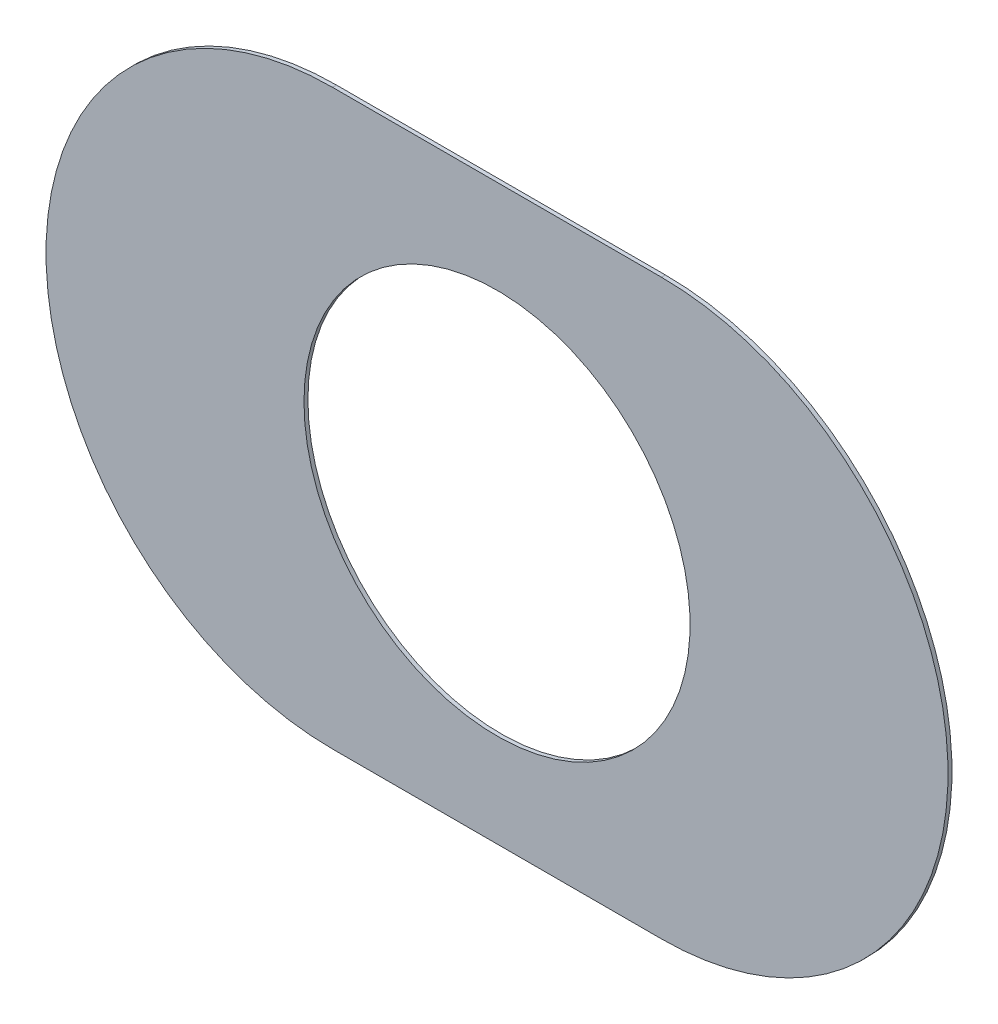
ISO-10303-21;
HEADER;
FILE_DESCRIPTION(('STEP AP214'),'2;1');
FILE_NAME('part.step','',(''),(''),'','','');
FILE_SCHEMA(('AUTOMOTIVE_DESIGN { 1 0 10303 214 1 1 1 1 }'));
ENDSEC;
DATA;
#1=APPLICATION_CONTEXT('core data for automotive mechanical design processes');
#2=APPLICATION_PROTOCOL_DEFINITION('international standard','automotive_design',2000,#1);
#3=PRODUCT_CONTEXT('',#1,'mechanical');
#4=PRODUCT('Part','Part','',(#3));
#5=PRODUCT_RELATED_PRODUCT_CATEGORY('part','',(#4));
#6=PRODUCT_DEFINITION_FORMATION('','',#4);
#7=PRODUCT_DEFINITION_CONTEXT('part definition',#1,'design');
#8=PRODUCT_DEFINITION('design','',#6,#7);
#9=PRODUCT_DEFINITION_SHAPE('','',#8);
#10=(LENGTH_UNIT() NAMED_UNIT(*) SI_UNIT(.MILLI.,.METRE.));
#11=(NAMED_UNIT(*) PLANE_ANGLE_UNIT() SI_UNIT($,.RADIAN.));
#12=(NAMED_UNIT(*) SI_UNIT($,.STERADIAN.) SOLID_ANGLE_UNIT());
#13=UNCERTAINTY_MEASURE_WITH_UNIT(LENGTH_MEASURE(1.E-05),#10,'distance_accuracy_value','');
#14=(GEOMETRIC_REPRESENTATION_CONTEXT(3) GLOBAL_UNCERTAINTY_ASSIGNED_CONTEXT((#13)) GLOBAL_UNIT_ASSIGNED_CONTEXT((#10,
#11,#12)) REPRESENTATION_CONTEXT('',''));
#15=CARTESIAN_POINT('',(0.,0.,0.));
#16=DIRECTION('',(0.,0.,1.));
#17=DIRECTION('',(1.,0.,0.));
#18=AXIS2_PLACEMENT_3D('',#15,#16,#17);
#19=CARTESIAN_POINT('',(1.54999965727325,19.6200006854535,0.));
#20=DIRECTION('',(0.,0.,-1.));
#21=DIRECTION('',(0.,-1.,0.));
#22=AXIS2_PLACEMENT_3D('',#19,#20,#21);
#23=PLANE('',#22);
#24=CARTESIAN_POINT('',(1.54999965727325,19.6200006854535,0.));
#25=DIRECTION('',(0.,0.,1.));
#26=DIRECTION('',(1.,0.,0.));
#27=AXIS2_PLACEMENT_3D('',#24,#25,#26);
#28=CIRCLE('',#27,0.49);
#29=CARTESIAN_POINT('',(1.05999965727325,19.6200006854535,0.));
#30=VERTEX_POINT('',#29);
#31=EDGE_CURVE('E98',#30,#30,#28,.T.);
#32=ORIENTED_EDGE('',*,*,#31,.F.);
#33=EDGE_LOOP('',(#32));
#34=FACE_BOUND('',#33,.T.);
#35=CARTESIAN_POINT('',(1.96740611181985,19.6200006854535,0.));
#36=DIRECTION('',(0.,0.,-1.));
#37=DIRECTION('',(0.,1.,0.));
#38=AXIS2_PLACEMENT_3D('',#35,#36,#37);
#39=CIRCLE('',#38,0.727257121659981);
#40=CARTESIAN_POINT('',(1.96740611181985,20.3472578071135,0.));
#41=VERTEX_POINT('',#40);
#42=CARTESIAN_POINT('',(1.96740611181985,18.8927435637935,0.));
#43=VERTEX_POINT('',#42);
#44=EDGE_CURVE('E21',#41,#43,#39,.T.);
#45=ORIENTED_EDGE('',*,*,#44,.F.);
#46=DIRECTION('',(1.,0.,0.));
#47=VECTOR('',#46,1.);
#48=CARTESIAN_POINT('',(1.13259320272665,20.3472578071135,0.));
#49=LINE('',#48,#47);
#50=CARTESIAN_POINT('',(1.13259320272665,20.3472578071135,0.));
#51=VERTEX_POINT('',#50);
#52=EDGE_CURVE('E91',#51,#41,#49,.T.);
#53=ORIENTED_EDGE('',*,*,#52,.F.);
#54=CARTESIAN_POINT('',(1.13259320272665,19.6200006854535,0.));
#55=DIRECTION('',(0.,0.,-1.));
#56=DIRECTION('',(0.,-1.,0.));
#57=AXIS2_PLACEMENT_3D('',#54,#55,#56);
#58=CIRCLE('',#57,0.727257121659981);
#59=CARTESIAN_POINT('',(1.13259320272665,18.8927435637935,0.));
#60=VERTEX_POINT('',#59);
#61=EDGE_CURVE('E74',#60,#51,#58,.T.);
#62=ORIENTED_EDGE('',*,*,#61,.F.);
#63=DIRECTION('',(-1.,0.,0.));
#64=VECTOR('',#63,1.);
#65=CARTESIAN_POINT('',(1.96740611181985,18.8927435637935,0.));
#66=LINE('',#65,#64);
#67=EDGE_CURVE('E112',#43,#60,#66,.T.);
#68=ORIENTED_EDGE('',*,*,#67,.F.);
#69=EDGE_LOOP('',(#45,#53,#62,#68));
#70=FACE_BOUND('',#69,.T.);
#71=ADVANCED_FACE('F17',(#34,#70),#23,.F.);
#72=CARTESIAN_POINT('',(1.54999965727325,19.6200006854535,-0.01));
#73=DIRECTION('',(0.,0.,-1.));
#74=DIRECTION('',(0.,-1.,0.));
#75=AXIS2_PLACEMENT_3D('',#72,#73,#74);
#76=PLANE('',#75);
#77=CARTESIAN_POINT('',(1.54999965727325,19.6200006854535,-0.01));
#78=DIRECTION('',(0.,0.,1.));
#79=DIRECTION('',(1.,0.,0.));
#80=AXIS2_PLACEMENT_3D('',#77,#78,#79);
#81=CIRCLE('',#80,0.49);
#82=CARTESIAN_POINT('',(1.05999965727325,19.6200006854535,-0.01));
#83=VERTEX_POINT('',#82);
#84=EDGE_CURVE('E119',#83,#83,#81,.T.);
#85=ORIENTED_EDGE('',*,*,#84,.T.);
#86=EDGE_LOOP('',(#85));
#87=FACE_BOUND('',#86,.T.);
#88=CARTESIAN_POINT('',(1.96740611181985,19.6200006854535,-0.01));
#89=DIRECTION('',(0.,0.,-1.));
#90=DIRECTION('',(0.,1.,0.));
#91=AXIS2_PLACEMENT_3D('',#88,#89,#90);
#92=CIRCLE('',#91,0.727257121659981);
#93=CARTESIAN_POINT('',(1.96740611181985,20.3472578071135,-0.01));
#94=VERTEX_POINT('',#93);
#95=CARTESIAN_POINT('',(1.96740611181985,18.8927435637935,-0.01));
#96=VERTEX_POINT('',#95);
#97=EDGE_CURVE('E11',#94,#96,#92,.T.);
#98=ORIENTED_EDGE('',*,*,#97,.T.);
#99=DIRECTION('',(-1.,0.,0.));
#100=VECTOR('',#99,1.);
#101=CARTESIAN_POINT('',(1.96740611181985,18.8927435637935,-0.01));
#102=LINE('',#101,#100);
#103=CARTESIAN_POINT('',(1.13259320272665,18.8927435637935,-0.01));
#104=VERTEX_POINT('',#103);
#105=EDGE_CURVE('E109',#96,#104,#102,.T.);
#106=ORIENTED_EDGE('',*,*,#105,.T.);
#107=CARTESIAN_POINT('',(1.13259320272665,19.6200006854535,-0.01));
#108=DIRECTION('',(0.,0.,-1.));
#109=DIRECTION('',(0.,-1.,0.));
#110=AXIS2_PLACEMENT_3D('',#107,#108,#109);
#111=CIRCLE('',#110,0.727257121659981);
#112=CARTESIAN_POINT('',(1.13259320272665,20.3472578071135,-0.01));
#113=VERTEX_POINT('',#112);
#114=EDGE_CURVE('E85',#104,#113,#111,.T.);
#115=ORIENTED_EDGE('',*,*,#114,.T.);
#116=DIRECTION('',(1.,0.,0.));
#117=VECTOR('',#116,1.);
#118=CARTESIAN_POINT('',(1.13259320272665,20.3472578071135,-0.01));
#119=LINE('',#118,#117);
#120=EDGE_CURVE('E92',#113,#94,#119,.T.);
#121=ORIENTED_EDGE('',*,*,#120,.T.);
#122=EDGE_LOOP('',(#98,#106,#115,#121));
#123=FACE_BOUND('',#122,.T.);
#124=ADVANCED_FACE('F137',(#87,#123),#76,.T.);
#125=CARTESIAN_POINT('',(1.96740611181985,19.6200006854535,0.));
#126=DIRECTION('',(0.,0.,-1.));
#127=DIRECTION('',(0.,1.,0.));
#128=AXIS2_PLACEMENT_3D('',#125,#126,#127);
#129=CYLINDRICAL_SURFACE('',#128,0.727257121659981);
#130=ORIENTED_EDGE('',*,*,#44,.T.);
#131=DIRECTION('',(0.,0.,-1.));
#132=VECTOR('',#131,1.);
#133=CARTESIAN_POINT('',(1.96740611181985,18.8927435637935,0.));
#134=LINE('',#133,#132);
#135=EDGE_CURVE('E111',#43,#96,#134,.T.);
#136=ORIENTED_EDGE('',*,*,#135,.T.);
#137=ORIENTED_EDGE('',*,*,#97,.F.);
#138=DIRECTION('',(0.,0.,-1.));
#139=VECTOR('',#138,1.);
#140=CARTESIAN_POINT('',(1.96740611181985,20.3472578071135,0.));
#141=LINE('',#140,#139);
#142=EDGE_CURVE('E97',#41,#94,#141,.T.);
#143=ORIENTED_EDGE('',*,*,#142,.F.);
#144=EDGE_LOOP('',(#130,#136,#137,#143));
#145=FACE_BOUND('',#144,.T.);
#146=ADVANCED_FACE('F134',(#145),#129,.T.);
#147=CARTESIAN_POINT('',(1.96740611181985,18.8927435637935,0.));
#148=DIRECTION('',(0.,-1.,0.));
#149=DIRECTION('',(0.,0.,-1.));
#150=AXIS2_PLACEMENT_3D('',#147,#148,#149);
#151=PLANE('',#150);
#152=ORIENTED_EDGE('',*,*,#67,.T.);
#153=DIRECTION('',(0.,0.,-1.));
#154=VECTOR('',#153,1.);
#155=CARTESIAN_POINT('',(1.13259320272665,18.8927435637935,0.));
#156=LINE('',#155,#154);
#157=EDGE_CURVE('E80',#60,#104,#156,.T.);
#158=ORIENTED_EDGE('',*,*,#157,.T.);
#159=ORIENTED_EDGE('',*,*,#105,.F.);
#160=ORIENTED_EDGE('',*,*,#135,.F.);
#161=EDGE_LOOP('',(#152,#158,#159,#160));
#162=FACE_BOUND('',#161,.T.);
#163=ADVANCED_FACE('F136',(#162),#151,.T.);
#164=CARTESIAN_POINT('',(1.13259320272665,19.6200006854535,0.));
#165=DIRECTION('',(0.,0.,-1.));
#166=DIRECTION('',(0.,-1.,0.));
#167=AXIS2_PLACEMENT_3D('',#164,#165,#166);
#168=CYLINDRICAL_SURFACE('',#167,0.727257121659981);
#169=ORIENTED_EDGE('',*,*,#61,.T.);
#170=DIRECTION('',(0.,0.,-1.));
#171=VECTOR('',#170,1.);
#172=CARTESIAN_POINT('',(1.13259320272665,20.3472578071135,0.));
#173=LINE('',#172,#171);
#174=EDGE_CURVE('E77',#51,#113,#173,.T.);
#175=ORIENTED_EDGE('',*,*,#174,.T.);
#176=ORIENTED_EDGE('',*,*,#114,.F.);
#177=ORIENTED_EDGE('',*,*,#157,.F.);
#178=EDGE_LOOP('',(#169,#175,#176,#177));
#179=FACE_BOUND('',#178,.T.);
#180=ADVANCED_FACE('F19',(#179),#168,.T.);
#181=CARTESIAN_POINT('',(1.13259320272665,20.3472578071135,0.));
#182=DIRECTION('',(0.,1.,0.));
#183=DIRECTION('',(1.,0.,0.));
#184=AXIS2_PLACEMENT_3D('',#181,#182,#183);
#185=PLANE('',#184);
#186=ORIENTED_EDGE('',*,*,#52,.T.);
#187=ORIENTED_EDGE('',*,*,#142,.T.);
#188=ORIENTED_EDGE('',*,*,#120,.F.);
#189=ORIENTED_EDGE('',*,*,#174,.F.);
#190=EDGE_LOOP('',(#186,#187,#188,#189));
#191=FACE_BOUND('',#190,.T.);
#192=ADVANCED_FACE('F89',(#191),#185,.T.);
#193=CARTESIAN_POINT('',(1.54999965727325,19.6200006854535,0.));
#194=DIRECTION('',(0.,0.,-1.));
#195=DIRECTION('',(1.,0.,0.));
#196=AXIS2_PLACEMENT_3D('',#193,#194,#195);
#197=CYLINDRICAL_SURFACE('',#196,0.49);
#198=ORIENTED_EDGE('',*,*,#84,.F.);
#199=DIRECTION('',(0.,0.,1.));
#200=VECTOR('',#199,1.);
#201=CARTESIAN_POINT('',(1.05999965727325,19.6200006854535,0.));
#202=LINE('',#201,#200);
#203=EDGE_CURVE('E104',#83,#30,#202,.T.);
#204=ORIENTED_EDGE('',*,*,#203,.T.);
#205=ORIENTED_EDGE('',*,*,#31,.T.);
#206=ORIENTED_EDGE('',*,*,#203,.F.);
#207=EDGE_LOOP('',(#198,#204,#205,#206));
#208=FACE_BOUND('',#207,.T.);
#209=ADVANCED_FACE('F150',(#208),#197,.F.);
#210=CLOSED_SHELL('',(#71,#124,#146,#163,#180,#192,#209));
#211=MANIFOLD_SOLID_BREP('B1',#210);
#212=ADVANCED_BREP_SHAPE_REPRESENTATION('',(#18,#211),#14);
#213=SHAPE_DEFINITION_REPRESENTATION(#9,#212);
ENDSEC;
END-ISO-10303-21;
